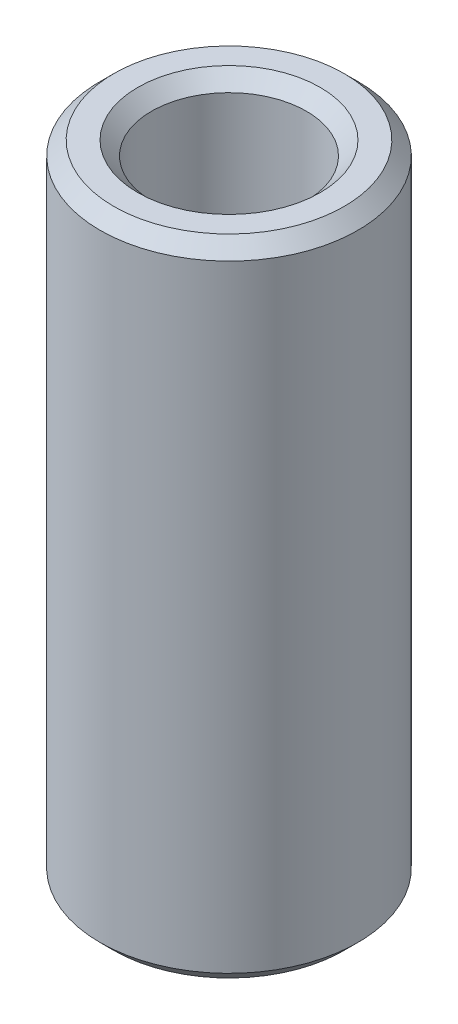
ISO-10303-21;
HEADER;
FILE_DESCRIPTION(('STEP AP214'),'2;1');
FILE_NAME('part.step','',(''),(''),'','','');
FILE_SCHEMA(('AUTOMOTIVE_DESIGN { 1 0 10303 214 1 1 1 1 }'));
ENDSEC;
DATA;
#1=APPLICATION_CONTEXT('core data for automotive mechanical design processes');
#2=APPLICATION_PROTOCOL_DEFINITION('international standard','automotive_design',2000,#1);
#3=PRODUCT_CONTEXT('',#1,'mechanical');
#4=PRODUCT('Part','Part','',(#3));
#5=PRODUCT_RELATED_PRODUCT_CATEGORY('part','',(#4));
#6=PRODUCT_DEFINITION_FORMATION('','',#4);
#7=PRODUCT_DEFINITION_CONTEXT('part definition',#1,'design');
#8=PRODUCT_DEFINITION('design','',#6,#7);
#9=PRODUCT_DEFINITION_SHAPE('','',#8);
#10=(LENGTH_UNIT() NAMED_UNIT(*) SI_UNIT(.MILLI.,.METRE.));
#11=(NAMED_UNIT(*) PLANE_ANGLE_UNIT() SI_UNIT($,.RADIAN.));
#12=(NAMED_UNIT(*) SI_UNIT($,.STERADIAN.) SOLID_ANGLE_UNIT());
#13=UNCERTAINTY_MEASURE_WITH_UNIT(LENGTH_MEASURE(1.E-05),#10,'distance_accuracy_value','');
#14=(GEOMETRIC_REPRESENTATION_CONTEXT(3) GLOBAL_UNCERTAINTY_ASSIGNED_CONTEXT((#13)) GLOBAL_UNIT_ASSIGNED_CONTEXT((#10,
#11,#12)) REPRESENTATION_CONTEXT('',''));
#15=CARTESIAN_POINT('',(0.,0.,0.));
#16=DIRECTION('',(0.,0.,1.));
#17=DIRECTION('',(1.,0.,0.));
#18=AXIS2_PLACEMENT_3D('',#15,#16,#17);
#19=CARTESIAN_POINT('',(0.,37.483927189874,0.));
#20=DIRECTION('',(0.,-1.,0.));
#21=DIRECTION('',(0.,0.,-1.));
#22=AXIS2_PLACEMENT_3D('',#19,#20,#21);
#23=CYLINDRICAL_SURFACE('',#22,7.5);
#24=CARTESIAN_POINT('',(0.,0.800417712397937,0.));
#25=DIRECTION('',(0.,1.,0.));
#26=DIRECTION('',(0.,0.,1.));
#27=AXIS2_PLACEMENT_3D('',#24,#25,#26);
#28=CIRCLE('',#27,7.5);
#29=CARTESIAN_POINT('',(0.,0.800417712397937,7.5));
#30=VERTEX_POINT('',#29);
#31=EDGE_CURVE('E10',#30,#30,#28,.T.);
#32=ORIENTED_EDGE('',*,*,#31,.T.);
#33=EDGE_LOOP('',(#32));
#34=FACE_BOUND('',#33,.T.);
#35=CARTESIAN_POINT('',(0.,36.6835094774761,0.));
#36=DIRECTION('',(0.,1.,0.));
#37=DIRECTION('',(0.,0.,1.));
#38=AXIS2_PLACEMENT_3D('',#35,#36,#37);
#39=CIRCLE('',#38,7.5);
#40=CARTESIAN_POINT('',(0.,36.6835094774761,7.5));
#41=VERTEX_POINT('',#40);
#42=EDGE_CURVE('E50',#41,#41,#39,.F.);
#43=ORIENTED_EDGE('',*,*,#42,.T.);
#44=EDGE_LOOP('',(#43));
#45=FACE_BOUND('',#44,.T.);
#46=ADVANCED_FACE('F39',(#34,#45),#23,.T.);
#47=CARTESIAN_POINT('',(0.,37.483927189874,0.));
#48=DIRECTION('',(0.,1.,0.));
#49=DIRECTION('',(0.,0.,1.));
#50=AXIS2_PLACEMENT_3D('',#47,#48,#49);
#51=PLANE('',#50);
#52=CARTESIAN_POINT('',(0.,37.483927189874,0.));
#53=DIRECTION('',(0.,1.,0.));
#54=DIRECTION('',(0.,0.,1.));
#55=AXIS2_PLACEMENT_3D('',#52,#53,#54);
#56=CIRCLE('',#55,5.3067600853006);
#57=CARTESIAN_POINT('',(0.,37.483927189874,5.3067600853006));
#58=VERTEX_POINT('',#57);
#59=EDGE_CURVE('E58',#58,#58,#56,.F.);
#60=ORIENTED_EDGE('',*,*,#59,.T.);
#61=EDGE_LOOP('',(#60));
#62=FACE_BOUND('',#61,.T.);
#63=CARTESIAN_POINT('',(0.,37.483927189874,0.));
#64=DIRECTION('',(0.,1.,0.));
#65=DIRECTION('',(0.,0.,1.));
#66=AXIS2_PLACEMENT_3D('',#63,#64,#65);
#67=CIRCLE('',#66,6.69958228760206);
#68=CARTESIAN_POINT('',(0.,37.483927189874,6.69958228760206));
#69=VERTEX_POINT('',#68);
#70=EDGE_CURVE('E61',#69,#69,#67,.T.);
#71=ORIENTED_EDGE('',*,*,#70,.T.);
#72=EDGE_LOOP('',(#71));
#73=FACE_BOUND('',#72,.T.);
#74=ADVANCED_FACE('F88',(#62,#73),#51,.T.);
#75=CARTESIAN_POINT('',(0.,0.,0.));
#76=DIRECTION('',(0.,1.,0.));
#77=DIRECTION('',(0.,0.,1.));
#78=AXIS2_PLACEMENT_3D('',#75,#76,#77);
#79=PLANE('',#78);
#80=CARTESIAN_POINT('',(0.,0.,0.));
#81=DIRECTION('',(0.,1.,0.));
#82=DIRECTION('',(0.,0.,1.));
#83=AXIS2_PLACEMENT_3D('',#80,#81,#82);
#84=CIRCLE('',#83,5.30676008530061);
#85=CARTESIAN_POINT('',(0.,0.,5.30676008530061));
#86=VERTEX_POINT('',#85);
#87=EDGE_CURVE('E51',#86,#86,#84,.T.);
#88=ORIENTED_EDGE('',*,*,#87,.T.);
#89=EDGE_LOOP('',(#88));
#90=FACE_BOUND('',#89,.T.);
#91=CARTESIAN_POINT('',(0.,0.,0.));
#92=DIRECTION('',(0.,1.,0.));
#93=DIRECTION('',(0.,0.,1.));
#94=AXIS2_PLACEMENT_3D('',#91,#92,#93);
#95=CIRCLE('',#94,6.69958228760206);
#96=CARTESIAN_POINT('',(0.,0.,6.69958228760206));
#97=VERTEX_POINT('',#96);
#98=EDGE_CURVE('E54',#97,#97,#95,.F.);
#99=ORIENTED_EDGE('',*,*,#98,.T.);
#100=EDGE_LOOP('',(#99));
#101=FACE_BOUND('',#100,.T.);
#102=ADVANCED_FACE('F83',(#90,#101),#79,.F.);
#103=CARTESIAN_POINT('',(0.,37.483927189874,0.));
#104=DIRECTION('',(0.,-1.,0.));
#105=DIRECTION('',(0.,0.,-1.));
#106=AXIS2_PLACEMENT_3D('',#103,#104,#105);
#107=CYLINDRICAL_SURFACE('',#106,4.50634237290268);
#108=CARTESIAN_POINT('',(0.,36.6835094774761,0.));
#109=DIRECTION('',(0.,1.,0.));
#110=DIRECTION('',(0.,0.,1.));
#111=AXIS2_PLACEMENT_3D('',#108,#109,#110);
#112=CIRCLE('',#111,4.50634237290268);
#113=CARTESIAN_POINT('',(0.,36.6835094774761,4.50634237290268));
#114=VERTEX_POINT('',#113);
#115=EDGE_CURVE('E67',#114,#114,#112,.T.);
#116=ORIENTED_EDGE('',*,*,#115,.T.);
#117=EDGE_LOOP('',(#116));
#118=FACE_BOUND('',#117,.T.);
#119=CARTESIAN_POINT('',(0.,0.800417712397944,0.));
#120=DIRECTION('',(0.,1.,0.));
#121=DIRECTION('',(0.,0.,1.));
#122=AXIS2_PLACEMENT_3D('',#119,#120,#121);
#123=CIRCLE('',#122,4.50634237290268);
#124=CARTESIAN_POINT('',(0.,0.800417712397944,4.50634237290268));
#125=VERTEX_POINT('',#124);
#126=EDGE_CURVE('E69',#125,#125,#123,.F.);
#127=ORIENTED_EDGE('',*,*,#126,.T.);
#128=EDGE_LOOP('',(#127));
#129=FACE_BOUND('',#128,.T.);
#130=ADVANCED_FACE('F71',(#118,#129),#107,.F.);
#131=CARTESIAN_POINT('',(0.,36.6835094774761,0.));
#132=DIRECTION('',(0.,1.,0.));
#133=DIRECTION('',(0.,0.,1.));
#134=AXIS2_PLACEMENT_3D('',#131,#132,#133);
#135=CONICAL_SURFACE('',#134,4.50634237290268,0.785398163397447);
#136=ORIENTED_EDGE('',*,*,#59,.F.);
#137=EDGE_LOOP('',(#136));
#138=FACE_BOUND('',#137,.T.);
#139=ORIENTED_EDGE('',*,*,#115,.F.);
#140=EDGE_LOOP('',(#139));
#141=FACE_BOUND('',#140,.T.);
#142=ADVANCED_FACE('F77',(#138,#141),#135,.F.);
#143=CARTESIAN_POINT('',(0.,0.,0.));
#144=DIRECTION('',(0.,-1.,0.));
#145=DIRECTION('',(0.,0.,-1.));
#146=AXIS2_PLACEMENT_3D('',#143,#144,#145);
#147=CONICAL_SURFACE('',#146,5.30676008530061,0.785398163397445);
#148=ORIENTED_EDGE('',*,*,#126,.F.);
#149=EDGE_LOOP('',(#148));
#150=FACE_BOUND('',#149,.T.);
#151=ORIENTED_EDGE('',*,*,#87,.F.);
#152=EDGE_LOOP('',(#151));
#153=FACE_BOUND('',#152,.T.);
#154=ADVANCED_FACE('F73',(#150,#153),#147,.F.);
#155=CARTESIAN_POINT('',(0.,0.800417712397937,0.));
#156=DIRECTION('',(0.,1.,0.));
#157=DIRECTION('',(0.,0.,1.));
#158=AXIS2_PLACEMENT_3D('',#155,#156,#157);
#159=CONICAL_SURFACE('',#158,7.5,0.78539816339745);
#160=ORIENTED_EDGE('',*,*,#98,.F.);
#161=EDGE_LOOP('',(#160));
#162=FACE_BOUND('',#161,.T.);
#163=ORIENTED_EDGE('',*,*,#31,.F.);
#164=EDGE_LOOP('',(#163));
#165=FACE_BOUND('',#164,.T.);
#166=ADVANCED_FACE('F76',(#162,#165),#159,.T.);
#167=CARTESIAN_POINT('',(0.,37.483927189874,0.));
#168=DIRECTION('',(0.,-1.,0.));
#169=DIRECTION('',(0.,0.,-1.));
#170=AXIS2_PLACEMENT_3D('',#167,#168,#169);
#171=CONICAL_SURFACE('',#170,6.69958228760206,0.785398163397444);
#172=ORIENTED_EDGE('',*,*,#42,.F.);
#173=EDGE_LOOP('',(#172));
#174=FACE_BOUND('',#173,.T.);
#175=ORIENTED_EDGE('',*,*,#70,.F.);
#176=EDGE_LOOP('',(#175));
#177=FACE_BOUND('',#176,.T.);
#178=ADVANCED_FACE('F45',(#174,#177),#171,.T.);
#179=CLOSED_SHELL('',(#46,#74,#102,#130,#142,#154,#166,#178));
#180=MANIFOLD_SOLID_BREP('B2',#179);
#181=ADVANCED_BREP_SHAPE_REPRESENTATION('',(#18,#180),#14);
#182=SHAPE_DEFINITION_REPRESENTATION(#9,#181);
ENDSEC;
END-ISO-10303-21;
